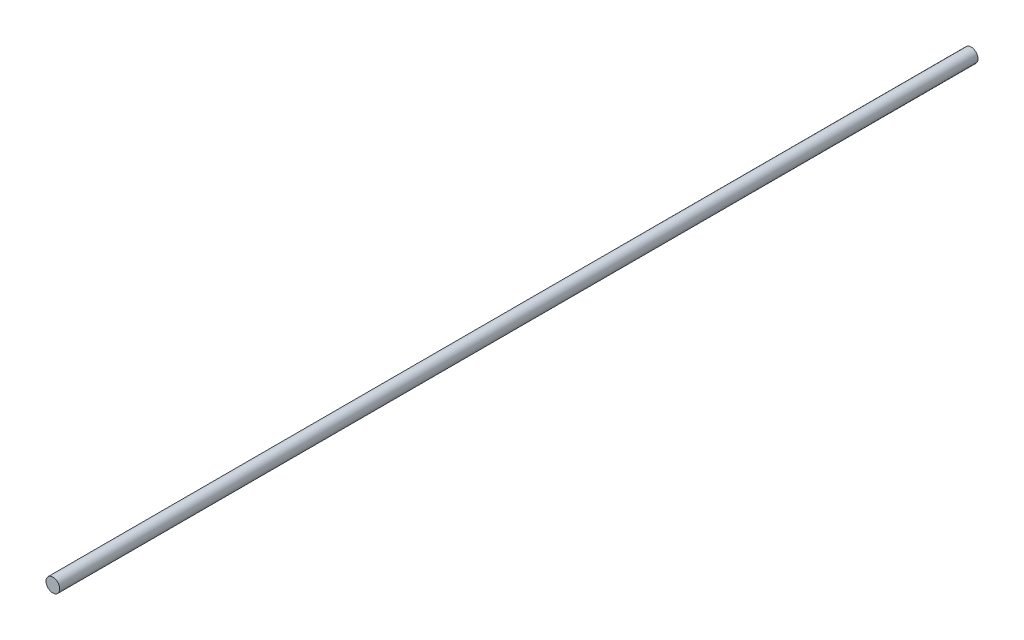
ISO-10303-21;
HEADER;
FILE_DESCRIPTION(('STEP AP214'),'2;1');
FILE_NAME('part.step','',(''),(''),'','','');
FILE_SCHEMA(('AUTOMOTIVE_DESIGN { 1 0 10303 214 1 1 1 1 }'));
ENDSEC;
DATA;
#1=APPLICATION_CONTEXT('core data for automotive mechanical design processes');
#2=APPLICATION_PROTOCOL_DEFINITION('international standard','automotive_design',2000,#1);
#3=PRODUCT_CONTEXT('',#1,'mechanical');
#4=PRODUCT('Part','Part','',(#3));
#5=PRODUCT_RELATED_PRODUCT_CATEGORY('part','',(#4));
#6=PRODUCT_DEFINITION_FORMATION('','',#4);
#7=PRODUCT_DEFINITION_CONTEXT('part definition',#1,'design');
#8=PRODUCT_DEFINITION('design','',#6,#7);
#9=PRODUCT_DEFINITION_SHAPE('','',#8);
#10=(LENGTH_UNIT() NAMED_UNIT(*) SI_UNIT(.MILLI.,.METRE.));
#11=(NAMED_UNIT(*) PLANE_ANGLE_UNIT() SI_UNIT($,.RADIAN.));
#12=(NAMED_UNIT(*) SI_UNIT($,.STERADIAN.) SOLID_ANGLE_UNIT());
#13=UNCERTAINTY_MEASURE_WITH_UNIT(LENGTH_MEASURE(1.E-05),#10,'distance_accuracy_value','');
#14=(GEOMETRIC_REPRESENTATION_CONTEXT(3) GLOBAL_UNCERTAINTY_ASSIGNED_CONTEXT((#13)) GLOBAL_UNIT_ASSIGNED_CONTEXT((#10,
#11,#12)) REPRESENTATION_CONTEXT('',''));
#15=CARTESIAN_POINT('',(0.,0.,0.));
#16=DIRECTION('',(0.,0.,1.));
#17=DIRECTION('',(1.,0.,0.));
#18=AXIS2_PLACEMENT_3D('',#15,#16,#17);
#19=CARTESIAN_POINT('',(0.,0.,200.));
#20=DIRECTION('',(0.,0.,-1.));
#21=DIRECTION('',(-1.,0.,0.));
#22=AXIS2_PLACEMENT_3D('',#19,#20,#21);
#23=CYLINDRICAL_SURFACE('',#22,3.);
#24=CARTESIAN_POINT('',(0.,0.,200.));
#25=DIRECTION('',(0.,0.,1.));
#26=DIRECTION('',(1.,0.,0.));
#27=AXIS2_PLACEMENT_3D('',#24,#25,#26);
#28=CIRCLE('',#27,3.);
#29=CARTESIAN_POINT('',(3.,0.,200.));
#30=VERTEX_POINT('',#29);
#31=EDGE_CURVE('E10',#30,#30,#28,.T.);
#32=ORIENTED_EDGE('',*,*,#31,.F.);
#33=EDGE_LOOP('',(#32));
#34=FACE_BOUND('',#33,.T.);
#35=CARTESIAN_POINT('',(0.,0.,-200.));
#36=DIRECTION('',(0.,0.,1.));
#37=DIRECTION('',(1.,0.,0.));
#38=AXIS2_PLACEMENT_3D('',#35,#36,#37);
#39=CIRCLE('',#38,3.);
#40=CARTESIAN_POINT('',(3.,0.,-200.));
#41=VERTEX_POINT('',#40);
#42=EDGE_CURVE('E35',#41,#41,#39,.T.);
#43=ORIENTED_EDGE('',*,*,#42,.T.);
#44=EDGE_LOOP('',(#43));
#45=FACE_BOUND('',#44,.T.);
#46=ADVANCED_FACE('F32',(#34,#45),#23,.T.);
#47=CARTESIAN_POINT('',(0.,0.,200.));
#48=DIRECTION('',(0.,0.,1.));
#49=DIRECTION('',(1.,0.,0.));
#50=AXIS2_PLACEMENT_3D('',#47,#48,#49);
#51=PLANE('',#50);
#52=ORIENTED_EDGE('',*,*,#31,.T.);
#53=EDGE_LOOP('',(#52));
#54=FACE_BOUND('',#53,.T.);
#55=ADVANCED_FACE('F47',(#54),#51,.T.);
#56=CARTESIAN_POINT('',(0.,0.,-200.));
#57=DIRECTION('',(0.,0.,1.));
#58=DIRECTION('',(1.,0.,0.));
#59=AXIS2_PLACEMENT_3D('',#56,#57,#58);
#60=PLANE('',#59);
#61=ORIENTED_EDGE('',*,*,#42,.F.);
#62=EDGE_LOOP('',(#61));
#63=FACE_BOUND('',#62,.T.);
#64=ADVANCED_FACE('F45',(#63),#60,.F.);
#65=CLOSED_SHELL('',(#46,#55,#64));
#66=MANIFOLD_SOLID_BREP('B2',#65);
#67=ADVANCED_BREP_SHAPE_REPRESENTATION('',(#18,#66),#14);
#68=SHAPE_DEFINITION_REPRESENTATION(#9,#67);
ENDSEC;
END-ISO-10303-21;
